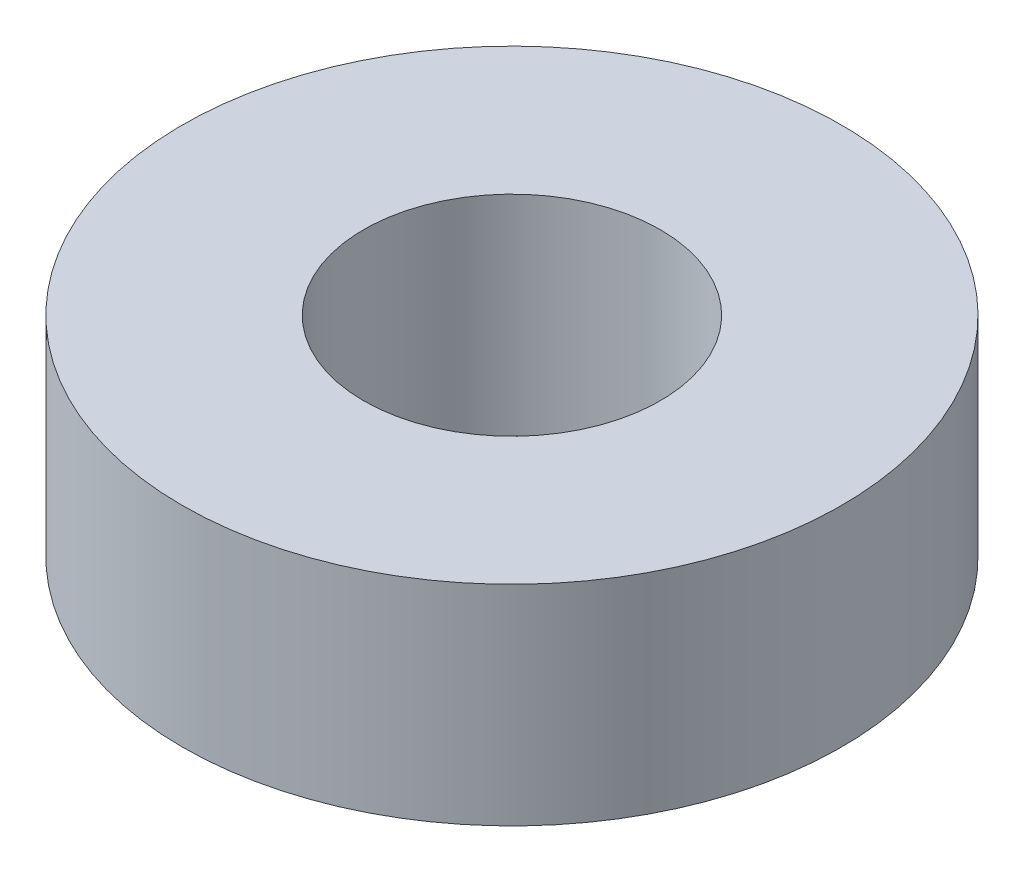
ISO-10303-21;
HEADER;
FILE_DESCRIPTION(('STEP AP214'),'2;1');
FILE_NAME('part.step','',(''),(''),'','','');
FILE_SCHEMA(('AUTOMOTIVE_DESIGN { 1 0 10303 214 1 1 1 1 }'));
ENDSEC;
DATA;
#1=APPLICATION_CONTEXT('core data for automotive mechanical design processes');
#2=APPLICATION_PROTOCOL_DEFINITION('international standard','automotive_design',2000,#1);
#3=PRODUCT_CONTEXT('',#1,'mechanical');
#4=PRODUCT('Part','Part','',(#3));
#5=PRODUCT_RELATED_PRODUCT_CATEGORY('part','',(#4));
#6=PRODUCT_DEFINITION_FORMATION('','',#4);
#7=PRODUCT_DEFINITION_CONTEXT('part definition',#1,'design');
#8=PRODUCT_DEFINITION('design','',#6,#7);
#9=PRODUCT_DEFINITION_SHAPE('','',#8);
#10=(LENGTH_UNIT() NAMED_UNIT(*) SI_UNIT(.MILLI.,.METRE.));
#11=(NAMED_UNIT(*) PLANE_ANGLE_UNIT() SI_UNIT($,.RADIAN.));
#12=(NAMED_UNIT(*) SI_UNIT($,.STERADIAN.) SOLID_ANGLE_UNIT());
#13=UNCERTAINTY_MEASURE_WITH_UNIT(LENGTH_MEASURE(1.E-05),#10,'distance_accuracy_value','');
#14=(GEOMETRIC_REPRESENTATION_CONTEXT(3) GLOBAL_UNCERTAINTY_ASSIGNED_CONTEXT((#13)) GLOBAL_UNIT_ASSIGNED_CONTEXT((#10,
#11,#12)) REPRESENTATION_CONTEXT('',''));
#15=CARTESIAN_POINT('',(0.,0.,0.));
#16=DIRECTION('',(0.,0.,1.));
#17=DIRECTION('',(1.,0.,0.));
#18=AXIS2_PLACEMENT_3D('',#15,#16,#17);
#19=CARTESIAN_POINT('',(0.,3.175,0.));
#20=DIRECTION('',(0.,1.,0.));
#21=DIRECTION('',(0.,0.,1.));
#22=AXIS2_PLACEMENT_3D('',#19,#20,#21);
#23=PLANE('',#22);
#24=CARTESIAN_POINT('',(0.,3.175,0.));
#25=DIRECTION('',(0.,1.,0.));
#26=DIRECTION('',(0.,0.,1.));
#27=AXIS2_PLACEMENT_3D('',#24,#25,#26);
#28=CIRCLE('',#27,5.);
#29=CARTESIAN_POINT('',(0.,3.175,5.));
#30=VERTEX_POINT('',#29);
#31=EDGE_CURVE('E10',#30,#30,#28,.T.);
#32=ORIENTED_EDGE('',*,*,#31,.T.);
#33=EDGE_LOOP('',(#32));
#34=FACE_BOUND('',#33,.T.);
#35=CARTESIAN_POINT('',(0.,3.175,0.));
#36=DIRECTION('',(0.,1.,0.));
#37=DIRECTION('',(0.,0.,1.));
#38=AXIS2_PLACEMENT_3D('',#35,#36,#37);
#39=CIRCLE('',#38,2.25);
#40=CARTESIAN_POINT('',(0.,3.175,2.25));
#41=VERTEX_POINT('',#40);
#42=EDGE_CURVE('E48',#41,#41,#39,.T.);
#43=ORIENTED_EDGE('',*,*,#42,.F.);
#44=EDGE_LOOP('',(#43));
#45=FACE_BOUND('',#44,.T.);
#46=ADVANCED_FACE('F37',(#34,#45),#23,.T.);
#47=CARTESIAN_POINT('',(0.,0.,0.));
#48=DIRECTION('',(0.,1.,0.));
#49=DIRECTION('',(0.,0.,1.));
#50=AXIS2_PLACEMENT_3D('',#47,#48,#49);
#51=PLANE('',#50);
#52=CARTESIAN_POINT('',(0.,0.,0.));
#53=DIRECTION('',(0.,1.,0.));
#54=DIRECTION('',(0.,0.,1.));
#55=AXIS2_PLACEMENT_3D('',#52,#53,#54);
#56=CIRCLE('',#55,5.);
#57=CARTESIAN_POINT('',(0.,0.,5.));
#58=VERTEX_POINT('',#57);
#59=EDGE_CURVE('E41',#58,#58,#56,.T.);
#60=ORIENTED_EDGE('',*,*,#59,.F.);
#61=EDGE_LOOP('',(#60));
#62=FACE_BOUND('',#61,.T.);
#63=CARTESIAN_POINT('',(0.,0.,0.));
#64=DIRECTION('',(0.,1.,0.));
#65=DIRECTION('',(0.,0.,1.));
#66=AXIS2_PLACEMENT_3D('',#63,#64,#65);
#67=CIRCLE('',#66,2.25);
#68=CARTESIAN_POINT('',(0.,0.,2.25));
#69=VERTEX_POINT('',#68);
#70=EDGE_CURVE('E50',#69,#69,#67,.T.);
#71=ORIENTED_EDGE('',*,*,#70,.T.);
#72=EDGE_LOOP('',(#71));
#73=FACE_BOUND('',#72,.T.);
#74=ADVANCED_FACE('F60',(#62,#73),#51,.F.);
#75=CARTESIAN_POINT('',(0.,3.175,0.));
#76=DIRECTION('',(0.,-1.,0.));
#77=DIRECTION('',(0.,0.,-1.));
#78=AXIS2_PLACEMENT_3D('',#75,#76,#77);
#79=CYLINDRICAL_SURFACE('',#78,5.);
#80=ORIENTED_EDGE('',*,*,#31,.F.);
#81=EDGE_LOOP('',(#80));
#82=FACE_BOUND('',#81,.T.);
#83=ORIENTED_EDGE('',*,*,#59,.T.);
#84=EDGE_LOOP('',(#83));
#85=FACE_BOUND('',#84,.T.);
#86=ADVANCED_FACE('F39',(#82,#85),#79,.T.);
#87=CARTESIAN_POINT('',(0.,3.175,0.));
#88=DIRECTION('',(0.,-1.,0.));
#89=DIRECTION('',(0.,0.,-1.));
#90=AXIS2_PLACEMENT_3D('',#87,#88,#89);
#91=CYLINDRICAL_SURFACE('',#90,2.25);
#92=ORIENTED_EDGE('',*,*,#42,.T.);
#93=EDGE_LOOP('',(#92));
#94=FACE_BOUND('',#93,.T.);
#95=ORIENTED_EDGE('',*,*,#70,.F.);
#96=EDGE_LOOP('',(#95));
#97=FACE_BOUND('',#96,.T.);
#98=ADVANCED_FACE('F56',(#94,#97),#91,.F.);
#99=CLOSED_SHELL('',(#46,#74,#86,#98));
#100=MANIFOLD_SOLID_BREP('B2',#99);
#101=ADVANCED_BREP_SHAPE_REPRESENTATION('',(#18,#100),#14);
#102=SHAPE_DEFINITION_REPRESENTATION(#9,#101);
ENDSEC;
END-ISO-10303-21;
